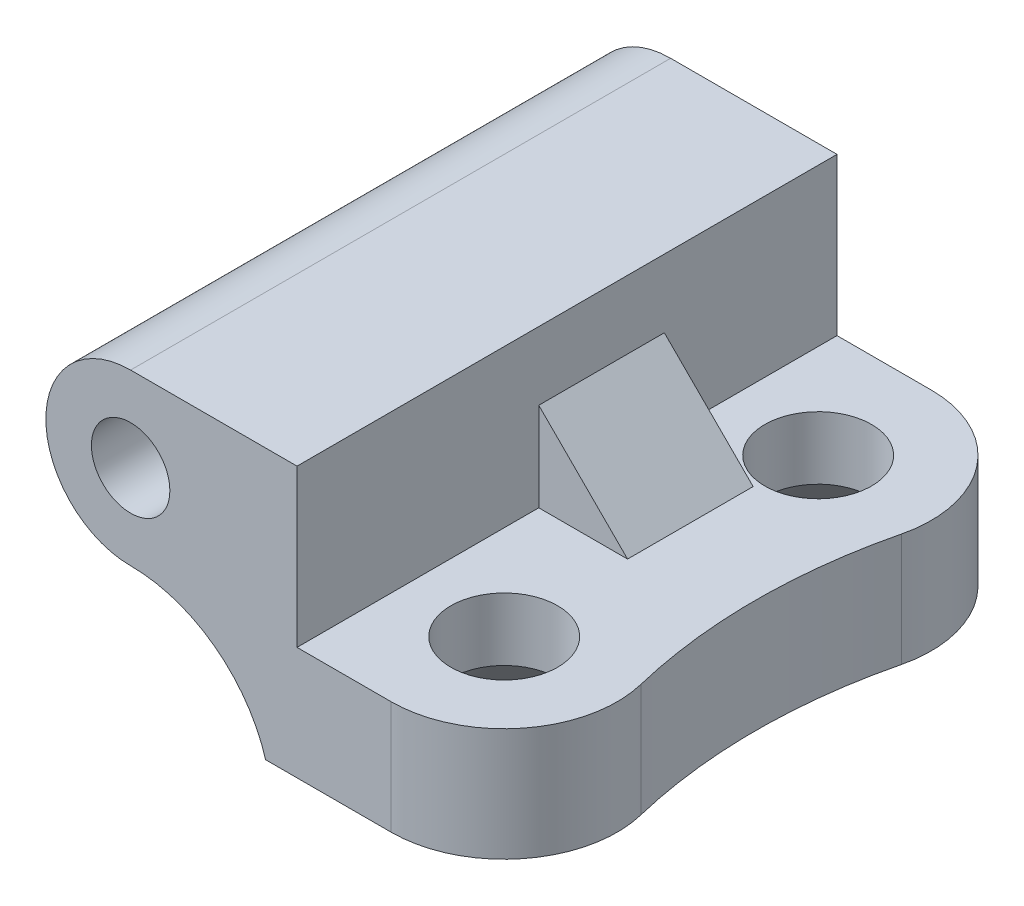
ISO-10303-21;
HEADER;
FILE_DESCRIPTION(('STEP AP214'),'2;1');
FILE_NAME('part.step','',(''),(''),'','','');
FILE_SCHEMA(('AUTOMOTIVE_DESIGN { 1 0 10303 214 1 1 1 1 }'));
ENDSEC;
DATA;
#1=APPLICATION_CONTEXT('core data for automotive mechanical design processes');
#2=APPLICATION_PROTOCOL_DEFINITION('international standard','automotive_design',2000,#1);
#3=PRODUCT_CONTEXT('',#1,'mechanical');
#4=PRODUCT('Part','Part','',(#3));
#5=PRODUCT_RELATED_PRODUCT_CATEGORY('part','',(#4));
#6=PRODUCT_DEFINITION_FORMATION('','',#4);
#7=PRODUCT_DEFINITION_CONTEXT('part definition',#1,'design');
#8=PRODUCT_DEFINITION('design','',#6,#7);
#9=PRODUCT_DEFINITION_SHAPE('','',#8);
#10=(LENGTH_UNIT() NAMED_UNIT(*) SI_UNIT(.MILLI.,.METRE.));
#11=(NAMED_UNIT(*) PLANE_ANGLE_UNIT() SI_UNIT($,.RADIAN.));
#12=(NAMED_UNIT(*) SI_UNIT($,.STERADIAN.) SOLID_ANGLE_UNIT());
#13=UNCERTAINTY_MEASURE_WITH_UNIT(LENGTH_MEASURE(1.E-05),#10,'distance_accuracy_value','');
#14=(GEOMETRIC_REPRESENTATION_CONTEXT(3) GLOBAL_UNCERTAINTY_ASSIGNED_CONTEXT((#13)) GLOBAL_UNIT_ASSIGNED_CONTEXT((#10,
#11,#12)) REPRESENTATION_CONTEXT('',''));
#15=CARTESIAN_POINT('',(0.,0.,0.));
#16=DIRECTION('',(0.,0.,1.));
#17=DIRECTION('',(1.,0.,0.));
#18=AXIS2_PLACEMENT_3D('',#15,#16,#17);
#19=CARTESIAN_POINT('',(5.3,-2.3,17.2));
#20=DIRECTION('',(0.,-1.,0.));
#21=DIRECTION('',(0.,0.,-1.));
#22=AXIS2_PLACEMENT_3D('',#19,#20,#21);
#23=PLANE('',#22);
#24=CARTESIAN_POINT('',(8.29999999999999,-2.3,3.6));
#25=DIRECTION('',(0.,-1.,0.));
#26=DIRECTION('',(0.,0.,-1.));
#27=AXIS2_PLACEMENT_3D('',#24,#25,#26);
#28=CIRCLE('',#27,1.7);
#29=CARTESIAN_POINT('',(8.29999999999999,-2.3,1.9));
#30=VERTEX_POINT('',#29);
#31=EDGE_CURVE('E39',#30,#30,#28,.T.);
#32=ORIENTED_EDGE('',*,*,#31,.T.);
#33=EDGE_LOOP('',(#32));
#34=FACE_BOUND('',#33,.T.);
#35=CARTESIAN_POINT('',(8.3,-2.3,13.6));
#36=DIRECTION('',(0.,-1.,0.));
#37=DIRECTION('',(0.,0.,-1.));
#38=AXIS2_PLACEMENT_3D('',#35,#36,#37);
#39=CIRCLE('',#38,1.7);
#40=CARTESIAN_POINT('',(8.3,-2.3,11.9));
#41=VERTEX_POINT('',#40);
#42=EDGE_CURVE('E155',#41,#41,#39,.T.);
#43=ORIENTED_EDGE('',*,*,#42,.T.);
#44=EDGE_LOOP('',(#43));
#45=FACE_BOUND('',#44,.T.);
#46=DIRECTION('',(1.,0.,0.));
#47=VECTOR('',#46,1.);
#48=CARTESIAN_POINT('',(8.12842712474619,-2.3,9.5));
#49=LINE('',#48,#47);
#50=CARTESIAN_POINT('',(5.3,-2.3,9.5));
#51=VERTEX_POINT('',#50);
#52=CARTESIAN_POINT('',(8.12842712474619,-2.3,9.5));
#53=VERTEX_POINT('',#52);
#54=EDGE_CURVE('E131',#51,#53,#49,.T.);
#55=ORIENTED_EDGE('',*,*,#54,.F.);
#56=DIRECTION('',(0.,0.,-1.));
#57=VECTOR('',#56,1.);
#58=CARTESIAN_POINT('',(5.3,-2.3,17.2));
#59=LINE('',#58,#57);
#60=CARTESIAN_POINT('',(5.3,-2.3,17.2));
#61=VERTEX_POINT('',#60);
#62=EDGE_CURVE('E148',#61,#51,#59,.T.);
#63=ORIENTED_EDGE('',*,*,#62,.F.);
#64=DIRECTION('',(-1.,0.,0.));
#65=VECTOR('',#64,1.);
#66=CARTESIAN_POINT('',(5.3,-2.3,17.2));
#67=LINE('',#66,#65);
#68=CARTESIAN_POINT('',(8.3,-2.3,17.2));
#69=VERTEX_POINT('',#68);
#70=EDGE_CURVE('E188',#69,#61,#67,.T.);
#71=ORIENTED_EDGE('',*,*,#70,.F.);
#72=CARTESIAN_POINT('',(8.3,-2.3,13.6));
#73=DIRECTION('',(0.,-1.,0.));
#74=DIRECTION('',(0.,0.,-1.));
#75=AXIS2_PLACEMENT_3D('',#72,#73,#74);
#76=CIRCLE('',#75,3.6);
#77=CARTESIAN_POINT('',(11.7977917981073,-2.3,12.7482649842271));
#78=VERTEX_POINT('',#77);
#79=EDGE_CURVE('E11',#78,#69,#76,.T.);
#80=ORIENTED_EDGE('',*,*,#79,.F.);
#81=CARTESIAN_POINT('',(28.8333333333334,-2.3,8.6));
#82=DIRECTION('',(0.,-1.,0.));
#83=DIRECTION('',(0.,0.,-1.));
#84=AXIS2_PLACEMENT_3D('',#81,#82,#83);
#85=CIRCLE('',#84,17.5333333333334);
#86=CARTESIAN_POINT('',(11.7977917981073,-2.3,4.45173501577287));
#87=VERTEX_POINT('',#86);
#88=EDGE_CURVE('E223',#78,#87,#85,.T.);
#89=ORIENTED_EDGE('',*,*,#88,.T.);
#90=CARTESIAN_POINT('',(8.29999999999999,-2.3,3.6));
#91=DIRECTION('',(0.,-1.,0.));
#92=DIRECTION('',(0.,0.,-1.));
#93=AXIS2_PLACEMENT_3D('',#90,#91,#92);
#94=CIRCLE('',#93,3.6);
#95=CARTESIAN_POINT('',(8.29999999999999,-2.3,0.));
#96=VERTEX_POINT('',#95);
#97=EDGE_CURVE('E44',#96,#87,#94,.T.);
#98=ORIENTED_EDGE('',*,*,#97,.F.);
#99=DIRECTION('',(-1.,0.,0.));
#100=VECTOR('',#99,1.);
#101=CARTESIAN_POINT('',(5.3,-2.3,0.));
#102=LINE('',#101,#100);
#103=CARTESIAN_POINT('',(5.3,-2.3,0.));
#104=VERTEX_POINT('',#103);
#105=EDGE_CURVE('E202',#96,#104,#102,.T.);
#106=ORIENTED_EDGE('',*,*,#105,.T.);
#107=CARTESIAN_POINT('',(5.3,-2.3,5.5));
#108=VERTEX_POINT('',#107);
#109=EDGE_CURVE('E218',#108,#104,#59,.T.);
#110=ORIENTED_EDGE('',*,*,#109,.F.);
#111=DIRECTION('',(1.,0.,0.));
#112=VECTOR('',#111,1.);
#113=CARTESIAN_POINT('',(8.12842712474619,-2.3,5.5));
#114=LINE('',#113,#112);
#115=CARTESIAN_POINT('',(8.12842712474619,-2.3,5.5));
#116=VERTEX_POINT('',#115);
#117=EDGE_CURVE('E52',#108,#116,#114,.T.);
#118=ORIENTED_EDGE('',*,*,#117,.T.);
#119=DIRECTION('',(0.,0.,-1.));
#120=VECTOR('',#119,1.);
#121=CARTESIAN_POINT('',(8.12842712474619,-2.3,9.5));
#122=LINE('',#121,#120);
#123=EDGE_CURVE('E142',#53,#116,#122,.T.);
#124=ORIENTED_EDGE('',*,*,#123,.F.);
#125=EDGE_LOOP('',(#55,#63,#71,#80,#89,#98,#106,#110,#118,#124));
#126=FACE_BOUND('',#125,.T.);
#127=ADVANCED_FACE('F35',(#34,#45,#126),#23,.F.);
#128=CARTESIAN_POINT('',(5.3,2.7,17.2));
#129=DIRECTION('',(-1.,0.,0.));
#130=DIRECTION('',(0.,0.,1.));
#131=AXIS2_PLACEMENT_3D('',#128,#129,#130);
#132=PLANE('',#131);
#133=DIRECTION('',(0.,-1.,0.));
#134=VECTOR('',#133,1.);
#135=CARTESIAN_POINT('',(5.3,-2.3,9.5));
#136=LINE('',#135,#134);
#137=CARTESIAN_POINT('',(5.3,0.528427124746191,9.5));
#138=VERTEX_POINT('',#137);
#139=EDGE_CURVE('E129',#138,#51,#136,.T.);
#140=ORIENTED_EDGE('',*,*,#139,.F.);
#141=DIRECTION('',(0.,0.,-1.));
#142=VECTOR('',#141,1.);
#143=CARTESIAN_POINT('',(5.3,0.528427124746191,9.5));
#144=LINE('',#143,#142);
#145=CARTESIAN_POINT('',(5.3,0.528427124746191,5.5));
#146=VERTEX_POINT('',#145);
#147=EDGE_CURVE('E137',#138,#146,#144,.T.);
#148=ORIENTED_EDGE('',*,*,#147,.T.);
#149=DIRECTION('',(0.,-1.,0.));
#150=VECTOR('',#149,1.);
#151=CARTESIAN_POINT('',(5.3,-2.3,5.5));
#152=LINE('',#151,#150);
#153=EDGE_CURVE('E154',#146,#108,#152,.T.);
#154=ORIENTED_EDGE('',*,*,#153,.T.);
#155=ORIENTED_EDGE('',*,*,#109,.T.);
#156=DIRECTION('',(0.,1.,0.));
#157=VECTOR('',#156,1.);
#158=CARTESIAN_POINT('',(5.3,2.7,0.));
#159=LINE('',#158,#157);
#160=CARTESIAN_POINT('',(5.3,2.7,0.));
#161=VERTEX_POINT('',#160);
#162=EDGE_CURVE('E205',#104,#161,#159,.T.);
#163=ORIENTED_EDGE('',*,*,#162,.T.);
#164=DIRECTION('',(0.,0.,-1.));
#165=VECTOR('',#164,1.);
#166=CARTESIAN_POINT('',(5.3,2.7,17.2));
#167=LINE('',#166,#165);
#168=CARTESIAN_POINT('',(5.3,2.7,17.2));
#169=VERTEX_POINT('',#168);
#170=EDGE_CURVE('E215',#169,#161,#167,.T.);
#171=ORIENTED_EDGE('',*,*,#170,.F.);
#172=DIRECTION('',(0.,1.,0.));
#173=VECTOR('',#172,1.);
#174=CARTESIAN_POINT('',(5.3,2.7,17.2));
#175=LINE('',#174,#173);
#176=EDGE_CURVE('E190',#61,#169,#175,.T.);
#177=ORIENTED_EDGE('',*,*,#176,.F.);
#178=ORIENTED_EDGE('',*,*,#62,.T.);
#179=EDGE_LOOP('',(#140,#148,#154,#155,#163,#171,#177,#178));
#180=FACE_BOUND('',#179,.T.);
#181=ADVANCED_FACE('F145',(#180),#132,.F.);
#182=CARTESIAN_POINT('',(0.,-7.1890625,17.2));
#183=DIRECTION('',(0.,0.,-1.));
#184=DIRECTION('',(-1.,0.,0.));
#185=AXIS2_PLACEMENT_3D('',#182,#183,#184);
#186=PLANE('',#185);
#187=CARTESIAN_POINT('',(0.,0.,17.2));
#188=DIRECTION('',(0.,0.,1.));
#189=DIRECTION('',(1.,0.,0.));
#190=AXIS2_PLACEMENT_3D('',#187,#188,#189);
#191=CIRCLE('',#190,1.25);
#192=CARTESIAN_POINT('',(1.25,0.,17.2));
#193=VERTEX_POINT('',#192);
#194=EDGE_CURVE('E175',#193,#193,#191,.T.);
#195=ORIENTED_EDGE('',*,*,#194,.F.);
#196=EDGE_LOOP('',(#195));
#197=FACE_BOUND('',#196,.T.);
#198=DIRECTION('',(0.,-1.,0.));
#199=VECTOR('',#198,1.);
#200=CARTESIAN_POINT('',(8.3,2.7,17.2));
#201=LINE('',#200,#199);
#202=CARTESIAN_POINT('',(8.3,-5.9,17.2));
#203=VERTEX_POINT('',#202);
#204=EDGE_CURVE('E167',#69,#203,#201,.T.);
#205=ORIENTED_EDGE('',*,*,#204,.F.);
#206=ORIENTED_EDGE('',*,*,#70,.T.);
#207=ORIENTED_EDGE('',*,*,#176,.T.);
#208=DIRECTION('',(-1.,0.,0.));
#209=VECTOR('',#208,1.);
#210=CARTESIAN_POINT('',(0.,2.7,17.2));
#211=LINE('',#210,#209);
#212=CARTESIAN_POINT('',(0.,2.7,17.2));
#213=VERTEX_POINT('',#212);
#214=EDGE_CURVE('E192',#169,#213,#211,.T.);
#215=ORIENTED_EDGE('',*,*,#214,.T.);
#216=CARTESIAN_POINT('',(0.,0.,17.2));
#217=DIRECTION('',(0.,0.,1.));
#218=DIRECTION('',(1.,0.,0.));
#219=AXIS2_PLACEMENT_3D('',#216,#217,#218);
#220=CIRCLE('',#219,2.7);
#221=CARTESIAN_POINT('',(0.,-2.7,17.2));
#222=VERTEX_POINT('',#221);
#223=EDGE_CURVE('E194',#213,#222,#220,.T.);
#224=ORIENTED_EDGE('',*,*,#223,.T.);
#225=CARTESIAN_POINT('',(0.,-7.1890625,17.2));
#226=DIRECTION('',(0.,0.,-1.));
#227=DIRECTION('',(-1.,0.,0.));
#228=AXIS2_PLACEMENT_3D('',#225,#226,#227);
#229=CIRCLE('',#228,4.48906249999999);
#230=CARTESIAN_POINT('',(4.3,-5.9,17.2));
#231=VERTEX_POINT('',#230);
#232=EDGE_CURVE('E181',#222,#231,#229,.T.);
#233=ORIENTED_EDGE('',*,*,#232,.T.);
#234=DIRECTION('',(1.,0.,0.));
#235=VECTOR('',#234,1.);
#236=CARTESIAN_POINT('',(12.8,-5.9,17.2));
#237=LINE('',#236,#235);
#238=EDGE_CURVE('E184',#231,#203,#237,.T.);
#239=ORIENTED_EDGE('',*,*,#238,.T.);
#240=EDGE_LOOP('',(#205,#206,#207,#215,#224,#233,#239));
#241=FACE_BOUND('',#240,.T.);
#242=ADVANCED_FACE('F258',(#197,#241),#186,.F.);
#243=CARTESIAN_POINT('',(0.,-7.1890625,0.));
#244=DIRECTION('',(0.,0.,-1.));
#245=DIRECTION('',(-1.,0.,0.));
#246=AXIS2_PLACEMENT_3D('',#243,#244,#245);
#247=PLANE('',#246);
#248=CARTESIAN_POINT('',(0.,0.,0.));
#249=DIRECTION('',(0.,0.,1.));
#250=DIRECTION('',(1.,0.,0.));
#251=AXIS2_PLACEMENT_3D('',#248,#249,#250);
#252=CIRCLE('',#251,1.25);
#253=CARTESIAN_POINT('',(1.25,0.,0.));
#254=VERTEX_POINT('',#253);
#255=EDGE_CURVE('E169',#254,#254,#252,.T.);
#256=ORIENTED_EDGE('',*,*,#255,.T.);
#257=EDGE_LOOP('',(#256));
#258=FACE_BOUND('',#257,.T.);
#259=ORIENTED_EDGE('',*,*,#105,.F.);
#260=DIRECTION('',(0.,-1.,0.));
#261=VECTOR('',#260,1.);
#262=CARTESIAN_POINT('',(8.29999999999999,2.7,0.));
#263=LINE('',#262,#261);
#264=CARTESIAN_POINT('',(8.29999999999999,-5.9,0.));
#265=VERTEX_POINT('',#264);
#266=EDGE_CURVE('E170',#96,#265,#263,.T.);
#267=ORIENTED_EDGE('',*,*,#266,.T.);
#268=DIRECTION('',(1.,0.,0.));
#269=VECTOR('',#268,1.);
#270=CARTESIAN_POINT('',(12.8,-5.9,0.));
#271=LINE('',#270,#269);
#272=CARTESIAN_POINT('',(4.3,-5.9,0.));
#273=VERTEX_POINT('',#272);
#274=EDGE_CURVE('E199',#273,#265,#271,.T.);
#275=ORIENTED_EDGE('',*,*,#274,.F.);
#276=CARTESIAN_POINT('',(0.,-7.1890625,0.));
#277=DIRECTION('',(0.,0.,-1.));
#278=DIRECTION('',(-1.,0.,0.));
#279=AXIS2_PLACEMENT_3D('',#276,#277,#278);
#280=CIRCLE('',#279,4.48906249999999);
#281=CARTESIAN_POINT('',(0.,-2.7,0.));
#282=VERTEX_POINT('',#281);
#283=EDGE_CURVE('E178',#282,#273,#280,.T.);
#284=ORIENTED_EDGE('',*,*,#283,.F.);
#285=CARTESIAN_POINT('',(0.,0.,0.));
#286=DIRECTION('',(0.,0.,1.));
#287=DIRECTION('',(1.,0.,0.));
#288=AXIS2_PLACEMENT_3D('',#285,#286,#287);
#289=CIRCLE('',#288,2.7);
#290=CARTESIAN_POINT('',(0.,2.7,0.));
#291=VERTEX_POINT('',#290);
#292=EDGE_CURVE('E185',#291,#282,#289,.T.);
#293=ORIENTED_EDGE('',*,*,#292,.F.);
#294=DIRECTION('',(-1.,0.,0.));
#295=VECTOR('',#294,1.);
#296=CARTESIAN_POINT('',(0.,2.7,0.));
#297=LINE('',#296,#295);
#298=EDGE_CURVE('E207',#161,#291,#297,.T.);
#299=ORIENTED_EDGE('',*,*,#298,.F.);
#300=ORIENTED_EDGE('',*,*,#162,.F.);
#301=EDGE_LOOP('',(#259,#267,#275,#284,#293,#299,#300));
#302=FACE_BOUND('',#301,.T.);
#303=ADVANCED_FACE('F249',(#258,#302),#247,.T.);
#304=CARTESIAN_POINT('',(12.8,-5.9,17.2));
#305=DIRECTION('',(0.,1.,0.));
#306=DIRECTION('',(-1.,0.,0.));
#307=AXIS2_PLACEMENT_3D('',#304,#305,#306);
#308=PLANE('',#307);
#309=CARTESIAN_POINT('',(8.29999999999999,-5.9,3.6));
#310=DIRECTION('',(0.,-1.,0.));
#311=DIRECTION('',(0.,0.,-1.));
#312=AXIS2_PLACEMENT_3D('',#309,#310,#311);
#313=CIRCLE('',#312,3.3);
#314=CARTESIAN_POINT('',(8.29999999999999,-5.9,0.299999999999999));
#315=VERTEX_POINT('',#314);
#316=EDGE_CURVE('E240',#315,#315,#313,.T.);
#317=ORIENTED_EDGE('',*,*,#316,.F.);
#318=EDGE_LOOP('',(#317));
#319=FACE_BOUND('',#318,.T.);
#320=CARTESIAN_POINT('',(8.3,-5.9,13.6));
#321=DIRECTION('',(0.,-1.,0.));
#322=DIRECTION('',(0.,0.,-1.));
#323=AXIS2_PLACEMENT_3D('',#320,#321,#322);
#324=CIRCLE('',#323,3.3);
#325=CARTESIAN_POINT('',(8.3,-5.9,10.3));
#326=VERTEX_POINT('',#325);
#327=EDGE_CURVE('E231',#326,#326,#324,.T.);
#328=ORIENTED_EDGE('',*,*,#327,.F.);
#329=EDGE_LOOP('',(#328));
#330=FACE_BOUND('',#329,.T.);
#331=CARTESIAN_POINT('',(8.3,-5.9,13.6));
#332=DIRECTION('',(0.,-1.,0.));
#333=DIRECTION('',(1.,0.,0.));
#334=AXIS2_PLACEMENT_3D('',#331,#332,#333);
#335=CIRCLE('',#334,3.6);
#336=CARTESIAN_POINT('',(11.7977917981072,-5.9,12.7482649842271));
#337=VERTEX_POINT('',#336);
#338=EDGE_CURVE('E141',#337,#203,#335,.T.);
#339=ORIENTED_EDGE('',*,*,#338,.T.);
#340=ORIENTED_EDGE('',*,*,#238,.F.);
#341=DIRECTION('',(0.,0.,-1.));
#342=VECTOR('',#341,1.);
#343=CARTESIAN_POINT('',(4.3,-5.9,17.2));
#344=LINE('',#343,#342);
#345=EDGE_CURVE('E220',#231,#273,#344,.T.);
#346=ORIENTED_EDGE('',*,*,#345,.T.);
#347=ORIENTED_EDGE('',*,*,#274,.T.);
#348=CARTESIAN_POINT('',(8.29999999999999,-5.9,3.6));
#349=DIRECTION('',(0.,-1.,0.));
#350=DIRECTION('',(1.,0.,0.));
#351=AXIS2_PLACEMENT_3D('',#348,#349,#350);
#352=CIRCLE('',#351,3.6);
#353=CARTESIAN_POINT('',(11.7977917981072,-5.9,4.45173501577287));
#354=VERTEX_POINT('',#353);
#355=EDGE_CURVE('E163',#265,#354,#352,.T.);
#356=ORIENTED_EDGE('',*,*,#355,.T.);
#357=CARTESIAN_POINT('',(28.8333333333334,-5.9,8.6));
#358=DIRECTION('',(0.,-1.,0.));
#359=DIRECTION('',(1.,0.,0.));
#360=AXIS2_PLACEMENT_3D('',#357,#358,#359);
#361=CIRCLE('',#360,17.5333333333334);
#362=EDGE_CURVE('E161',#337,#354,#361,.T.);
#363=ORIENTED_EDGE('',*,*,#362,.F.);
#364=EDGE_LOOP('',(#339,#340,#346,#347,#356,#363));
#365=FACE_BOUND('',#364,.T.);
#366=ADVANCED_FACE('F246',(#319,#330,#365),#308,.F.);
#367=CARTESIAN_POINT('',(0.,-7.1890625,17.2));
#368=DIRECTION('',(0.,0.,-1.));
#369=DIRECTION('',(-1.,0.,0.));
#370=AXIS2_PLACEMENT_3D('',#367,#368,#369);
#371=CYLINDRICAL_SURFACE('',#370,4.48906249999999);
#372=ORIENTED_EDGE('',*,*,#283,.T.);
#373=ORIENTED_EDGE('',*,*,#345,.F.);
#374=ORIENTED_EDGE('',*,*,#232,.F.);
#375=DIRECTION('',(0.,0.,-1.));
#376=VECTOR('',#375,1.);
#377=CARTESIAN_POINT('',(0.,-2.7,17.2));
#378=LINE('',#377,#376);
#379=EDGE_CURVE('E196',#222,#282,#378,.T.);
#380=ORIENTED_EDGE('',*,*,#379,.T.);
#381=EDGE_LOOP('',(#372,#373,#374,#380));
#382=FACE_BOUND('',#381,.T.);
#383=ADVANCED_FACE('F37',(#382),#371,.F.);
#384=CARTESIAN_POINT('',(0.,2.7,17.2));
#385=DIRECTION('',(0.,-1.,0.));
#386=DIRECTION('',(0.,0.,-1.));
#387=AXIS2_PLACEMENT_3D('',#384,#385,#386);
#388=PLANE('',#387);
#389=ORIENTED_EDGE('',*,*,#298,.T.);
#390=DIRECTION('',(0.,0.,-1.));
#391=VECTOR('',#390,1.);
#392=CARTESIAN_POINT('',(0.,2.7,17.2));
#393=LINE('',#392,#391);
#394=EDGE_CURVE('E212',#213,#291,#393,.T.);
#395=ORIENTED_EDGE('',*,*,#394,.F.);
#396=ORIENTED_EDGE('',*,*,#214,.F.);
#397=ORIENTED_EDGE('',*,*,#170,.T.);
#398=EDGE_LOOP('',(#389,#395,#396,#397));
#399=FACE_BOUND('',#398,.T.);
#400=ADVANCED_FACE('F299',(#399),#388,.F.);
#401=CARTESIAN_POINT('',(0.,0.,17.2));
#402=DIRECTION('',(0.,0.,-1.));
#403=DIRECTION('',(-1.,0.,0.));
#404=AXIS2_PLACEMENT_3D('',#401,#402,#403);
#405=CYLINDRICAL_SURFACE('',#404,2.7);
#406=ORIENTED_EDGE('',*,*,#292,.T.);
#407=ORIENTED_EDGE('',*,*,#379,.F.);
#408=ORIENTED_EDGE('',*,*,#223,.F.);
#409=ORIENTED_EDGE('',*,*,#394,.T.);
#410=EDGE_LOOP('',(#406,#407,#408,#409));
#411=FACE_BOUND('',#410,.T.);
#412=ADVANCED_FACE('F286',(#411),#405,.T.);
#413=CARTESIAN_POINT('',(0.,0.,17.2));
#414=DIRECTION('',(0.,0.,-1.));
#415=DIRECTION('',(-1.,0.,0.));
#416=AXIS2_PLACEMENT_3D('',#413,#414,#415);
#417=CYLINDRICAL_SURFACE('',#416,1.25);
#418=ORIENTED_EDGE('',*,*,#194,.T.);
#419=EDGE_LOOP('',(#418));
#420=FACE_BOUND('',#419,.T.);
#421=ORIENTED_EDGE('',*,*,#255,.F.);
#422=EDGE_LOOP('',(#421));
#423=FACE_BOUND('',#422,.T.);
#424=ADVANCED_FACE('F279',(#420,#423),#417,.F.);
#425=CARTESIAN_POINT('',(8.3,2.7,13.6));
#426=DIRECTION('',(0.,-1.,0.));
#427=DIRECTION('',(1.,0.,0.));
#428=AXIS2_PLACEMENT_3D('',#425,#426,#427);
#429=CYLINDRICAL_SURFACE('',#428,3.6);
#430=ORIENTED_EDGE('',*,*,#79,.T.);
#431=ORIENTED_EDGE('',*,*,#204,.T.);
#432=ORIENTED_EDGE('',*,*,#338,.F.);
#433=DIRECTION('',(0.,-1.,0.));
#434=VECTOR('',#433,1.);
#435=CARTESIAN_POINT('',(11.7977917981073,2.7,12.7482649842271));
#436=LINE('',#435,#434);
#437=EDGE_CURVE('E166',#78,#337,#436,.T.);
#438=ORIENTED_EDGE('',*,*,#437,.F.);
#439=EDGE_LOOP('',(#430,#431,#432,#438));
#440=FACE_BOUND('',#439,.T.);
#441=ADVANCED_FACE('F277',(#440),#429,.T.);
#442=CARTESIAN_POINT('',(8.29999999999999,2.7,3.6));
#443=DIRECTION('',(0.,-1.,0.));
#444=DIRECTION('',(1.,0.,0.));
#445=AXIS2_PLACEMENT_3D('',#442,#443,#444);
#446=CYLINDRICAL_SURFACE('',#445,3.6);
#447=ORIENTED_EDGE('',*,*,#97,.T.);
#448=DIRECTION('',(0.,-1.,0.));
#449=VECTOR('',#448,1.);
#450=CARTESIAN_POINT('',(11.7977917981072,2.7,4.45173501577287));
#451=LINE('',#450,#449);
#452=EDGE_CURVE('E60',#87,#354,#451,.T.);
#453=ORIENTED_EDGE('',*,*,#452,.T.);
#454=ORIENTED_EDGE('',*,*,#355,.F.);
#455=ORIENTED_EDGE('',*,*,#266,.F.);
#456=EDGE_LOOP('',(#447,#453,#454,#455));
#457=FACE_BOUND('',#456,.T.);
#458=ADVANCED_FACE('F272',(#457),#446,.T.);
#459=CARTESIAN_POINT('',(28.8333333333334,2.7,8.6));
#460=DIRECTION('',(0.,-1.,0.));
#461=DIRECTION('',(1.,0.,0.));
#462=AXIS2_PLACEMENT_3D('',#459,#460,#461);
#463=CYLINDRICAL_SURFACE('',#462,17.5333333333334);
#464=ORIENTED_EDGE('',*,*,#437,.T.);
#465=ORIENTED_EDGE('',*,*,#362,.T.);
#466=ORIENTED_EDGE('',*,*,#452,.F.);
#467=ORIENTED_EDGE('',*,*,#88,.F.);
#468=EDGE_LOOP('',(#464,#465,#466,#467));
#469=FACE_BOUND('',#468,.T.);
#470=ADVANCED_FACE('F276',(#469),#463,.F.);
#471=CARTESIAN_POINT('',(8.12842712474619,-2.3,9.5));
#472=DIRECTION('',(-0.707106781186547,-0.707106781186548,0.));
#473=DIRECTION('',(0.707106781186548,-0.707106781186547,0.));
#474=AXIS2_PLACEMENT_3D('',#471,#472,#473);
#475=PLANE('',#474);
#476=DIRECTION('',(-0.707106781186548,0.707106781186547,0.));
#477=VECTOR('',#476,1.);
#478=CARTESIAN_POINT('',(8.12842712474619,-2.3,5.5));
#479=LINE('',#478,#477);
#480=EDGE_CURVE('E139',#116,#146,#479,.T.);
#481=ORIENTED_EDGE('',*,*,#480,.T.);
#482=ORIENTED_EDGE('',*,*,#147,.F.);
#483=DIRECTION('',(-0.707106781186548,0.707106781186547,0.));
#484=VECTOR('',#483,1.);
#485=CARTESIAN_POINT('',(8.12842712474619,-2.3,9.5));
#486=LINE('',#485,#484);
#487=EDGE_CURVE('E125',#53,#138,#486,.T.);
#488=ORIENTED_EDGE('',*,*,#487,.F.);
#489=ORIENTED_EDGE('',*,*,#123,.T.);
#490=EDGE_LOOP('',(#481,#482,#488,#489));
#491=FACE_BOUND('',#490,.T.);
#492=ADVANCED_FACE('F138',(#491),#475,.F.);
#493=CARTESIAN_POINT('',(0.,0.,9.5));
#494=DIRECTION('',(0.,0.,-1.));
#495=DIRECTION('',(-1.,0.,0.));
#496=AXIS2_PLACEMENT_3D('',#493,#494,#495);
#497=PLANE('',#496);
#498=ORIENTED_EDGE('',*,*,#487,.T.);
#499=ORIENTED_EDGE('',*,*,#139,.T.);
#500=ORIENTED_EDGE('',*,*,#54,.T.);
#501=EDGE_LOOP('',(#498,#499,#500));
#502=FACE_BOUND('',#501,.T.);
#503=ADVANCED_FACE('F127',(#502),#497,.F.);
#504=CARTESIAN_POINT('',(0.,0.,5.5));
#505=DIRECTION('',(0.,0.,-1.));
#506=DIRECTION('',(-1.,0.,0.));
#507=AXIS2_PLACEMENT_3D('',#504,#505,#506);
#508=PLANE('',#507);
#509=ORIENTED_EDGE('',*,*,#480,.F.);
#510=ORIENTED_EDGE('',*,*,#117,.F.);
#511=ORIENTED_EDGE('',*,*,#153,.F.);
#512=EDGE_LOOP('',(#509,#510,#511));
#513=FACE_BOUND('',#512,.T.);
#514=ADVANCED_FACE('F393',(#513),#508,.T.);
#515=CARTESIAN_POINT('',(8.3,-5.9,13.6));
#516=DIRECTION('',(0.,-1.,0.));
#517=DIRECTION('',(0.,0.,-1.));
#518=AXIS2_PLACEMENT_3D('',#515,#516,#517);
#519=CYLINDRICAL_SURFACE('',#518,1.7);
#520=CARTESIAN_POINT('',(8.3,-4.3,13.6));
#521=DIRECTION('',(0.,-1.,0.));
#522=DIRECTION('',(0.,0.,-1.));
#523=AXIS2_PLACEMENT_3D('',#520,#521,#522);
#524=CIRCLE('',#523,1.7);
#525=CARTESIAN_POINT('',(8.3,-4.3,11.9));
#526=VERTEX_POINT('',#525);
#527=EDGE_CURVE('E227',#526,#526,#524,.T.);
#528=ORIENTED_EDGE('',*,*,#527,.T.);
#529=EDGE_LOOP('',(#528));
#530=FACE_BOUND('',#529,.T.);
#531=ORIENTED_EDGE('',*,*,#42,.F.);
#532=EDGE_LOOP('',(#531));
#533=FACE_BOUND('',#532,.T.);
#534=ADVANCED_FACE('F400',(#530,#533),#519,.F.);
#535=CARTESIAN_POINT('',(8.3,-5.9,13.6));
#536=DIRECTION('',(0.,-1.,0.));
#537=DIRECTION('',(0.,0.,-1.));
#538=AXIS2_PLACEMENT_3D('',#535,#536,#537);
#539=CONICAL_SURFACE('',#538,3.3,0.785398163397449);
#540=ORIENTED_EDGE('',*,*,#527,.F.);
#541=EDGE_LOOP('',(#540));
#542=FACE_BOUND('',#541,.T.);
#543=ORIENTED_EDGE('',*,*,#327,.T.);
#544=EDGE_LOOP('',(#543));
#545=FACE_BOUND('',#544,.T.);
#546=ADVANCED_FACE('F407',(#542,#545),#539,.F.);
#547=CARTESIAN_POINT('',(8.29999999999999,-5.9,3.6));
#548=DIRECTION('',(0.,-1.,0.));
#549=DIRECTION('',(0.,0.,-1.));
#550=AXIS2_PLACEMENT_3D('',#547,#548,#549);
#551=CYLINDRICAL_SURFACE('',#550,1.7);
#552=CARTESIAN_POINT('',(8.29999999999999,-4.3,3.6));
#553=DIRECTION('',(0.,-1.,0.));
#554=DIRECTION('',(0.,0.,-1.));
#555=AXIS2_PLACEMENT_3D('',#552,#553,#554);
#556=CIRCLE('',#555,1.7);
#557=CARTESIAN_POINT('',(8.29999999999999,-4.3,1.9));
#558=VERTEX_POINT('',#557);
#559=EDGE_CURVE('E237',#558,#558,#556,.T.);
#560=ORIENTED_EDGE('',*,*,#559,.T.);
#561=EDGE_LOOP('',(#560));
#562=FACE_BOUND('',#561,.T.);
#563=ORIENTED_EDGE('',*,*,#31,.F.);
#564=EDGE_LOOP('',(#563));
#565=FACE_BOUND('',#564,.T.);
#566=ADVANCED_FACE('F415',(#562,#565),#551,.F.);
#567=CARTESIAN_POINT('',(8.29999999999999,-5.9,3.6));
#568=DIRECTION('',(0.,-1.,0.));
#569=DIRECTION('',(0.,0.,-1.));
#570=AXIS2_PLACEMENT_3D('',#567,#568,#569);
#571=CONICAL_SURFACE('',#570,3.3,0.785398163397449);
#572=ORIENTED_EDGE('',*,*,#559,.F.);
#573=EDGE_LOOP('',(#572));
#574=FACE_BOUND('',#573,.T.);
#575=ORIENTED_EDGE('',*,*,#316,.T.);
#576=EDGE_LOOP('',(#575));
#577=FACE_BOUND('',#576,.T.);
#578=ADVANCED_FACE('F244',(#574,#577),#571,.F.);
#579=CLOSED_SHELL('',(#127,#181,#242,#303,#366,#383,#400,#412,#424,#441,#458,#470,#492,#503,
#514,#534,#546,#566,#578));
#580=MANIFOLD_SOLID_BREP('B2',#579);
#581=ADVANCED_BREP_SHAPE_REPRESENTATION('',(#18,#580),#14);
#582=SHAPE_DEFINITION_REPRESENTATION(#9,#581);
ENDSEC;
END-ISO-10303-21;
